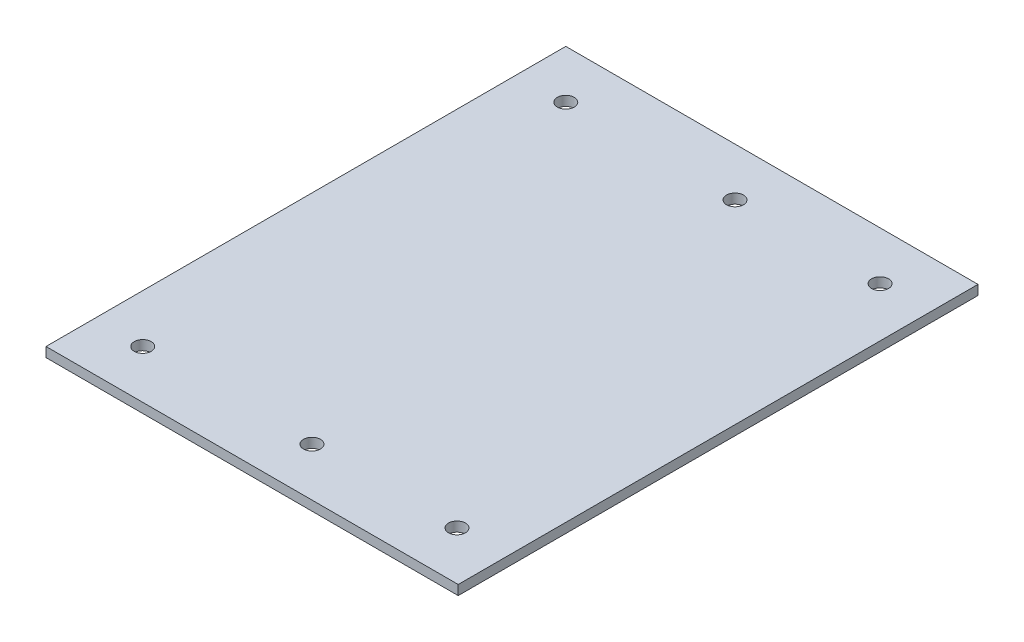
ISO-10303-21;
HEADER;
FILE_DESCRIPTION(('STEP AP214'),'2;1');
FILE_NAME('part.step','',(''),(''),'','','');
FILE_SCHEMA(('AUTOMOTIVE_DESIGN { 1 0 10303 214 1 1 1 1 }'));
ENDSEC;
DATA;
#1=APPLICATION_CONTEXT('core data for automotive mechanical design processes');
#2=APPLICATION_PROTOCOL_DEFINITION('international standard','automotive_design',2000,#1);
#3=PRODUCT_CONTEXT('',#1,'mechanical');
#4=PRODUCT('Part','Part','',(#3));
#5=PRODUCT_RELATED_PRODUCT_CATEGORY('part','',(#4));
#6=PRODUCT_DEFINITION_FORMATION('','',#4);
#7=PRODUCT_DEFINITION_CONTEXT('part definition',#1,'design');
#8=PRODUCT_DEFINITION('design','',#6,#7);
#9=PRODUCT_DEFINITION_SHAPE('','',#8);
#10=(LENGTH_UNIT() NAMED_UNIT(*) SI_UNIT(.MILLI.,.METRE.));
#11=(NAMED_UNIT(*) PLANE_ANGLE_UNIT() SI_UNIT($,.RADIAN.));
#12=(NAMED_UNIT(*) SI_UNIT($,.STERADIAN.) SOLID_ANGLE_UNIT());
#13=UNCERTAINTY_MEASURE_WITH_UNIT(LENGTH_MEASURE(1.E-05),#10,'distance_accuracy_value','');
#14=(GEOMETRIC_REPRESENTATION_CONTEXT(3) GLOBAL_UNCERTAINTY_ASSIGNED_CONTEXT((#13)) GLOBAL_UNIT_ASSIGNED_CONTEXT((#10,
#11,#12)) REPRESENTATION_CONTEXT('',''));
#15=CARTESIAN_POINT('',(0.,0.,0.));
#16=DIRECTION('',(0.,0.,1.));
#17=DIRECTION('',(1.,0.,0.));
#18=AXIS2_PLACEMENT_3D('',#15,#16,#17);
#19=CARTESIAN_POINT('',(0.,4.,0.));
#20=DIRECTION('',(0.,1.,0.));
#21=DIRECTION('',(0.,0.,1.));
#22=AXIS2_PLACEMENT_3D('',#19,#20,#21);
#23=PLANE('',#22);
#24=CARTESIAN_POINT('',(150.,4.,-185.));
#25=DIRECTION('',(0.,1.,0.));
#26=DIRECTION('',(0.,0.,1.));
#27=AXIS2_PLACEMENT_3D('',#24,#25,#26);
#28=CIRCLE('',#27,3.49999999999999);
#29=CARTESIAN_POINT('',(150.,4.,-181.5));
#30=VERTEX_POINT('',#29);
#31=EDGE_CURVE('E161',#30,#30,#28,.T.);
#32=ORIENTED_EDGE('',*,*,#31,.F.);
#33=EDGE_LOOP('',(#32));
#34=FACE_BOUND('',#33,.T.);
#35=CARTESIAN_POINT('',(90.,4.,-10.));
#36=DIRECTION('',(0.,1.,0.));
#37=DIRECTION('',(0.,0.,1.));
#38=AXIS2_PLACEMENT_3D('',#35,#36,#37);
#39=CIRCLE('',#38,3.50000000000001);
#40=CARTESIAN_POINT('',(90.,4.,-6.5));
#41=VERTEX_POINT('',#40);
#42=EDGE_CURVE('E146',#41,#41,#39,.T.);
#43=ORIENTED_EDGE('',*,*,#42,.F.);
#44=EDGE_LOOP('',(#43));
#45=FACE_BOUND('',#44,.T.);
#46=CARTESIAN_POINT('',(20.,4.,-10.));
#47=DIRECTION('',(0.,1.,0.));
#48=DIRECTION('',(0.,0.,1.));
#49=AXIS2_PLACEMENT_3D('',#46,#47,#48);
#50=CIRCLE('',#49,3.5);
#51=CARTESIAN_POINT('',(20.,4.,-6.5));
#52=VERTEX_POINT('',#51);
#53=EDGE_CURVE('E109',#52,#52,#50,.T.);
#54=ORIENTED_EDGE('',*,*,#53,.F.);
#55=EDGE_LOOP('',(#54));
#56=FACE_BOUND('',#55,.T.);
#57=DIRECTION('',(0.,0.,1.));
#58=VECTOR('',#57,1.);
#59=CARTESIAN_POINT('',(0.,4.,-205.));
#60=LINE('',#59,#58);
#61=CARTESIAN_POINT('',(0.,4.,-205.));
#62=VERTEX_POINT('',#61);
#63=CARTESIAN_POINT('',(0.,4.,10.));
#64=VERTEX_POINT('',#63);
#65=EDGE_CURVE('E92',#62,#64,#60,.T.);
#66=ORIENTED_EDGE('',*,*,#65,.T.);
#67=DIRECTION('',(1.,0.,0.));
#68=VECTOR('',#67,1.);
#69=CARTESIAN_POINT('',(0.,4.,10.));
#70=LINE('',#69,#68);
#71=CARTESIAN_POINT('',(170.5,4.,10.));
#72=VERTEX_POINT('',#71);
#73=EDGE_CURVE('E87',#64,#72,#70,.T.);
#74=ORIENTED_EDGE('',*,*,#73,.T.);
#75=DIRECTION('',(0.,0.,-1.));
#76=VECTOR('',#75,1.);
#77=CARTESIAN_POINT('',(170.5,4.,-205.));
#78=LINE('',#77,#76);
#79=CARTESIAN_POINT('',(170.5,4.,-205.));
#80=VERTEX_POINT('',#79);
#81=EDGE_CURVE('E90',#72,#80,#78,.T.);
#82=ORIENTED_EDGE('',*,*,#81,.T.);
#83=DIRECTION('',(-1.,0.,0.));
#84=VECTOR('',#83,1.);
#85=CARTESIAN_POINT('',(0.,4.,-205.));
#86=LINE('',#85,#84);
#87=EDGE_CURVE('E57',#80,#62,#86,.T.);
#88=ORIENTED_EDGE('',*,*,#87,.T.);
#89=EDGE_LOOP('',(#66,#74,#82,#88));
#90=FACE_BOUND('',#89,.T.);
#91=CARTESIAN_POINT('',(150.,4.,-10.));
#92=DIRECTION('',(0.,1.,0.));
#93=DIRECTION('',(0.,0.,1.));
#94=AXIS2_PLACEMENT_3D('',#91,#92,#93);
#95=CIRCLE('',#94,3.49999999999999);
#96=CARTESIAN_POINT('',(150.,4.,-6.50000000000001));
#97=VERTEX_POINT('',#96);
#98=EDGE_CURVE('E134',#97,#97,#95,.T.);
#99=ORIENTED_EDGE('',*,*,#98,.F.);
#100=EDGE_LOOP('',(#99));
#101=FACE_BOUND('',#100,.T.);
#102=CARTESIAN_POINT('',(90.,4.,-185.));
#103=DIRECTION('',(0.,1.,0.));
#104=DIRECTION('',(0.,0.,1.));
#105=AXIS2_PLACEMENT_3D('',#102,#103,#104);
#106=CIRCLE('',#105,3.50000000000001);
#107=CARTESIAN_POINT('',(90.,4.,-181.5));
#108=VERTEX_POINT('',#107);
#109=EDGE_CURVE('E153',#108,#108,#106,.T.);
#110=ORIENTED_EDGE('',*,*,#109,.F.);
#111=EDGE_LOOP('',(#110));
#112=FACE_BOUND('',#111,.T.);
#113=CARTESIAN_POINT('',(20.,4.,-185.));
#114=DIRECTION('',(0.,1.,0.));
#115=DIRECTION('',(0.,0.,1.));
#116=AXIS2_PLACEMENT_3D('',#113,#114,#115);
#117=CIRCLE('',#116,3.5);
#118=CARTESIAN_POINT('',(20.,4.,-181.5));
#119=VERTEX_POINT('',#118);
#120=EDGE_CURVE('E168',#119,#119,#117,.T.);
#121=ORIENTED_EDGE('',*,*,#120,.F.);
#122=EDGE_LOOP('',(#121));
#123=FACE_BOUND('',#122,.T.);
#124=ADVANCED_FACE('F40',(#34,#45,#56,#90,#101,#112,#123),#23,.T.);
#125=CARTESIAN_POINT('',(0.,0.,0.));
#126=DIRECTION('',(0.,1.,0.));
#127=DIRECTION('',(0.,0.,1.));
#128=AXIS2_PLACEMENT_3D('',#125,#126,#127);
#129=PLANE('',#128);
#130=DIRECTION('',(0.,0.,1.));
#131=VECTOR('',#130,1.);
#132=CARTESIAN_POINT('',(0.,0.,-205.));
#133=LINE('',#132,#131);
#134=CARTESIAN_POINT('',(0.,0.,-205.));
#135=VERTEX_POINT('',#134);
#136=CARTESIAN_POINT('',(0.,0.,10.));
#137=VERTEX_POINT('',#136);
#138=EDGE_CURVE('E104',#135,#137,#133,.T.);
#139=ORIENTED_EDGE('',*,*,#138,.F.);
#140=DIRECTION('',(-1.,0.,0.));
#141=VECTOR('',#140,1.);
#142=CARTESIAN_POINT('',(0.,0.,-205.));
#143=LINE('',#142,#141);
#144=CARTESIAN_POINT('',(170.5,0.,-205.));
#145=VERTEX_POINT('',#144);
#146=EDGE_CURVE('E80',#145,#135,#143,.T.);
#147=ORIENTED_EDGE('',*,*,#146,.F.);
#148=DIRECTION('',(0.,0.,-1.));
#149=VECTOR('',#148,1.);
#150=CARTESIAN_POINT('',(170.5,0.,-205.));
#151=LINE('',#150,#149);
#152=CARTESIAN_POINT('',(170.5,0.,10.));
#153=VERTEX_POINT('',#152);
#154=EDGE_CURVE('E74',#153,#145,#151,.T.);
#155=ORIENTED_EDGE('',*,*,#154,.F.);
#156=DIRECTION('',(1.,0.,0.));
#157=VECTOR('',#156,1.);
#158=CARTESIAN_POINT('',(0.,0.,10.));
#159=LINE('',#158,#157);
#160=EDGE_CURVE('E96',#137,#153,#159,.T.);
#161=ORIENTED_EDGE('',*,*,#160,.F.);
#162=EDGE_LOOP('',(#139,#147,#155,#161));
#163=FACE_BOUND('',#162,.T.);
#164=CARTESIAN_POINT('',(20.,0.,-10.));
#165=DIRECTION('',(0.,1.,0.));
#166=DIRECTION('',(0.,0.,1.));
#167=AXIS2_PLACEMENT_3D('',#164,#165,#166);
#168=CIRCLE('',#167,3.5);
#169=CARTESIAN_POINT('',(20.,0.,-6.5));
#170=VERTEX_POINT('',#169);
#171=EDGE_CURVE('E129',#170,#170,#168,.T.);
#172=ORIENTED_EDGE('',*,*,#171,.T.);
#173=EDGE_LOOP('',(#172));
#174=FACE_BOUND('',#173,.T.);
#175=CARTESIAN_POINT('',(150.,0.,-10.));
#176=DIRECTION('',(0.,1.,0.));
#177=DIRECTION('',(0.,0.,1.));
#178=AXIS2_PLACEMENT_3D('',#175,#176,#177);
#179=CIRCLE('',#178,3.49999999999999);
#180=CARTESIAN_POINT('',(150.,0.,-6.50000000000001));
#181=VERTEX_POINT('',#180);
#182=EDGE_CURVE('E141',#181,#181,#179,.T.);
#183=ORIENTED_EDGE('',*,*,#182,.T.);
#184=EDGE_LOOP('',(#183));
#185=FACE_BOUND('',#184,.T.);
#186=CARTESIAN_POINT('',(90.,0.,-10.));
#187=DIRECTION('',(0.,1.,0.));
#188=DIRECTION('',(0.,0.,1.));
#189=AXIS2_PLACEMENT_3D('',#186,#187,#188);
#190=CIRCLE('',#189,3.50000000000001);
#191=CARTESIAN_POINT('',(90.,0.,-6.5));
#192=VERTEX_POINT('',#191);
#193=EDGE_CURVE('E148',#192,#192,#190,.T.);
#194=ORIENTED_EDGE('',*,*,#193,.T.);
#195=EDGE_LOOP('',(#194));
#196=FACE_BOUND('',#195,.T.);
#197=CARTESIAN_POINT('',(90.,0.,-185.));
#198=DIRECTION('',(0.,1.,0.));
#199=DIRECTION('',(0.,0.,1.));
#200=AXIS2_PLACEMENT_3D('',#197,#198,#199);
#201=CIRCLE('',#200,3.50000000000001);
#202=CARTESIAN_POINT('',(90.,0.,-181.5));
#203=VERTEX_POINT('',#202);
#204=EDGE_CURVE('E156',#203,#203,#201,.T.);
#205=ORIENTED_EDGE('',*,*,#204,.T.);
#206=EDGE_LOOP('',(#205));
#207=FACE_BOUND('',#206,.T.);
#208=CARTESIAN_POINT('',(150.,0.,-185.));
#209=DIRECTION('',(0.,1.,0.));
#210=DIRECTION('',(0.,0.,1.));
#211=AXIS2_PLACEMENT_3D('',#208,#209,#210);
#212=CIRCLE('',#211,3.49999999999999);
#213=CARTESIAN_POINT('',(150.,0.,-181.5));
#214=VERTEX_POINT('',#213);
#215=EDGE_CURVE('E163',#214,#214,#212,.T.);
#216=ORIENTED_EDGE('',*,*,#215,.T.);
#217=EDGE_LOOP('',(#216));
#218=FACE_BOUND('',#217,.T.);
#219=CARTESIAN_POINT('',(20.,0.,-185.));
#220=DIRECTION('',(0.,1.,0.));
#221=DIRECTION('',(0.,0.,1.));
#222=AXIS2_PLACEMENT_3D('',#219,#220,#221);
#223=CIRCLE('',#222,3.5);
#224=CARTESIAN_POINT('',(20.,0.,-181.5));
#225=VERTEX_POINT('',#224);
#226=EDGE_CURVE('E170',#225,#225,#223,.T.);
#227=ORIENTED_EDGE('',*,*,#226,.T.);
#228=EDGE_LOOP('',(#227));
#229=FACE_BOUND('',#228,.T.);
#230=ADVANCED_FACE('F125',(#163,#174,#185,#196,#207,#218,#229),#129,.F.);
#231=CARTESIAN_POINT('',(0.,4.,-205.));
#232=DIRECTION('',(1.,0.,0.));
#233=DIRECTION('',(0.,0.,-1.));
#234=AXIS2_PLACEMENT_3D('',#231,#232,#233);
#235=PLANE('',#234);
#236=ORIENTED_EDGE('',*,*,#138,.T.);
#237=DIRECTION('',(0.,-1.,0.));
#238=VECTOR('',#237,1.);
#239=CARTESIAN_POINT('',(0.,4.,10.));
#240=LINE('',#239,#238);
#241=EDGE_CURVE('E12',#64,#137,#240,.T.);
#242=ORIENTED_EDGE('',*,*,#241,.F.);
#243=ORIENTED_EDGE('',*,*,#65,.F.);
#244=DIRECTION('',(0.,-1.,0.));
#245=VECTOR('',#244,1.);
#246=CARTESIAN_POINT('',(0.,4.,-205.));
#247=LINE('',#246,#245);
#248=EDGE_CURVE('E100',#62,#135,#247,.T.);
#249=ORIENTED_EDGE('',*,*,#248,.T.);
#250=EDGE_LOOP('',(#236,#242,#243,#249));
#251=FACE_BOUND('',#250,.T.);
#252=ADVANCED_FACE('F42',(#251),#235,.F.);
#253=CARTESIAN_POINT('',(0.,4.,10.));
#254=DIRECTION('',(0.,0.,-1.));
#255=DIRECTION('',(-1.,0.,0.));
#256=AXIS2_PLACEMENT_3D('',#253,#254,#255);
#257=PLANE('',#256);
#258=ORIENTED_EDGE('',*,*,#160,.T.);
#259=DIRECTION('',(0.,-1.,0.));
#260=VECTOR('',#259,1.);
#261=CARTESIAN_POINT('',(170.5,4.,10.));
#262=LINE('',#261,#260);
#263=EDGE_CURVE('E49',#72,#153,#262,.T.);
#264=ORIENTED_EDGE('',*,*,#263,.F.);
#265=ORIENTED_EDGE('',*,*,#73,.F.);
#266=ORIENTED_EDGE('',*,*,#241,.T.);
#267=EDGE_LOOP('',(#258,#264,#265,#266));
#268=FACE_BOUND('',#267,.T.);
#269=ADVANCED_FACE('F95',(#268),#257,.F.);
#270=CARTESIAN_POINT('',(170.5,4.,-205.));
#271=DIRECTION('',(-1.,0.,0.));
#272=DIRECTION('',(0.,0.,1.));
#273=AXIS2_PLACEMENT_3D('',#270,#271,#272);
#274=PLANE('',#273);
#275=ORIENTED_EDGE('',*,*,#154,.T.);
#276=DIRECTION('',(0.,-1.,0.));
#277=VECTOR('',#276,1.);
#278=CARTESIAN_POINT('',(170.5,4.,-205.));
#279=LINE('',#278,#277);
#280=EDGE_CURVE('E97',#80,#145,#279,.T.);
#281=ORIENTED_EDGE('',*,*,#280,.F.);
#282=ORIENTED_EDGE('',*,*,#81,.F.);
#283=ORIENTED_EDGE('',*,*,#263,.T.);
#284=EDGE_LOOP('',(#275,#281,#282,#283));
#285=FACE_BOUND('',#284,.T.);
#286=ADVANCED_FACE('F98',(#285),#274,.F.);
#287=CARTESIAN_POINT('',(0.,4.,-205.));
#288=DIRECTION('',(0.,0.,1.));
#289=DIRECTION('',(1.,0.,0.));
#290=AXIS2_PLACEMENT_3D('',#287,#288,#289);
#291=PLANE('',#290);
#292=ORIENTED_EDGE('',*,*,#146,.T.);
#293=ORIENTED_EDGE('',*,*,#248,.F.);
#294=ORIENTED_EDGE('',*,*,#87,.F.);
#295=ORIENTED_EDGE('',*,*,#280,.T.);
#296=EDGE_LOOP('',(#292,#293,#294,#295));
#297=FACE_BOUND('',#296,.T.);
#298=ADVANCED_FACE('F122',(#297),#291,.F.);
#299=CARTESIAN_POINT('',(20.,4.,-10.));
#300=DIRECTION('',(0.,-1.,0.));
#301=DIRECTION('',(0.,0.,-1.));
#302=AXIS2_PLACEMENT_3D('',#299,#300,#301);
#303=CYLINDRICAL_SURFACE('',#302,3.5);
#304=ORIENTED_EDGE('',*,*,#53,.T.);
#305=EDGE_LOOP('',(#304));
#306=FACE_BOUND('',#305,.T.);
#307=ORIENTED_EDGE('',*,*,#171,.F.);
#308=EDGE_LOOP('',(#307));
#309=FACE_BOUND('',#308,.T.);
#310=ADVANCED_FACE('F191',(#306,#309),#303,.F.);
#311=CARTESIAN_POINT('',(150.,4.,-10.));
#312=DIRECTION('',(0.,-1.,0.));
#313=DIRECTION('',(0.,0.,-1.));
#314=AXIS2_PLACEMENT_3D('',#311,#312,#313);
#315=CYLINDRICAL_SURFACE('',#314,3.49999999999999);
#316=ORIENTED_EDGE('',*,*,#98,.T.);
#317=EDGE_LOOP('',(#316));
#318=FACE_BOUND('',#317,.T.);
#319=ORIENTED_EDGE('',*,*,#182,.F.);
#320=EDGE_LOOP('',(#319));
#321=FACE_BOUND('',#320,.T.);
#322=ADVANCED_FACE('F237',(#318,#321),#315,.F.);
#323=CARTESIAN_POINT('',(90.,4.,-10.));
#324=DIRECTION('',(0.,-1.,0.));
#325=DIRECTION('',(0.,0.,-1.));
#326=AXIS2_PLACEMENT_3D('',#323,#324,#325);
#327=CYLINDRICAL_SURFACE('',#326,3.50000000000001);
#328=ORIENTED_EDGE('',*,*,#42,.T.);
#329=EDGE_LOOP('',(#328));
#330=FACE_BOUND('',#329,.T.);
#331=ORIENTED_EDGE('',*,*,#193,.F.);
#332=EDGE_LOOP('',(#331));
#333=FACE_BOUND('',#332,.T.);
#334=ADVANCED_FACE('F245',(#330,#333),#327,.F.);
#335=CARTESIAN_POINT('',(90.,4.,-185.));
#336=DIRECTION('',(0.,-1.,0.));
#337=DIRECTION('',(0.,0.,-1.));
#338=AXIS2_PLACEMENT_3D('',#335,#336,#337);
#339=CYLINDRICAL_SURFACE('',#338,3.50000000000001);
#340=ORIENTED_EDGE('',*,*,#109,.T.);
#341=EDGE_LOOP('',(#340));
#342=FACE_BOUND('',#341,.T.);
#343=ORIENTED_EDGE('',*,*,#204,.F.);
#344=EDGE_LOOP('',(#343));
#345=FACE_BOUND('',#344,.T.);
#346=ADVANCED_FACE('F253',(#342,#345),#339,.F.);
#347=CARTESIAN_POINT('',(150.,4.,-185.));
#348=DIRECTION('',(0.,-1.,0.));
#349=DIRECTION('',(0.,0.,-1.));
#350=AXIS2_PLACEMENT_3D('',#347,#348,#349);
#351=CYLINDRICAL_SURFACE('',#350,3.49999999999999);
#352=ORIENTED_EDGE('',*,*,#31,.T.);
#353=EDGE_LOOP('',(#352));
#354=FACE_BOUND('',#353,.T.);
#355=ORIENTED_EDGE('',*,*,#215,.F.);
#356=EDGE_LOOP('',(#355));
#357=FACE_BOUND('',#356,.T.);
#358=ADVANCED_FACE('F262',(#354,#357),#351,.F.);
#359=CARTESIAN_POINT('',(20.,4.,-185.));
#360=DIRECTION('',(0.,-1.,0.));
#361=DIRECTION('',(0.,0.,-1.));
#362=AXIS2_PLACEMENT_3D('',#359,#360,#361);
#363=CYLINDRICAL_SURFACE('',#362,3.5);
#364=ORIENTED_EDGE('',*,*,#120,.T.);
#365=EDGE_LOOP('',(#364));
#366=FACE_BOUND('',#365,.T.);
#367=ORIENTED_EDGE('',*,*,#226,.F.);
#368=EDGE_LOOP('',(#367));
#369=FACE_BOUND('',#368,.T.);
#370=ADVANCED_FACE('F178',(#366,#369),#363,.F.);
#371=CLOSED_SHELL('',(#124,#230,#252,#269,#286,#298,#310,#322,#334,#346,#358,#370));
#372=MANIFOLD_SOLID_BREP('B2',#371);
#373=ADVANCED_BREP_SHAPE_REPRESENTATION('',(#18,#372),#14);
#374=SHAPE_DEFINITION_REPRESENTATION(#9,#373);
ENDSEC;
END-ISO-10303-21;
